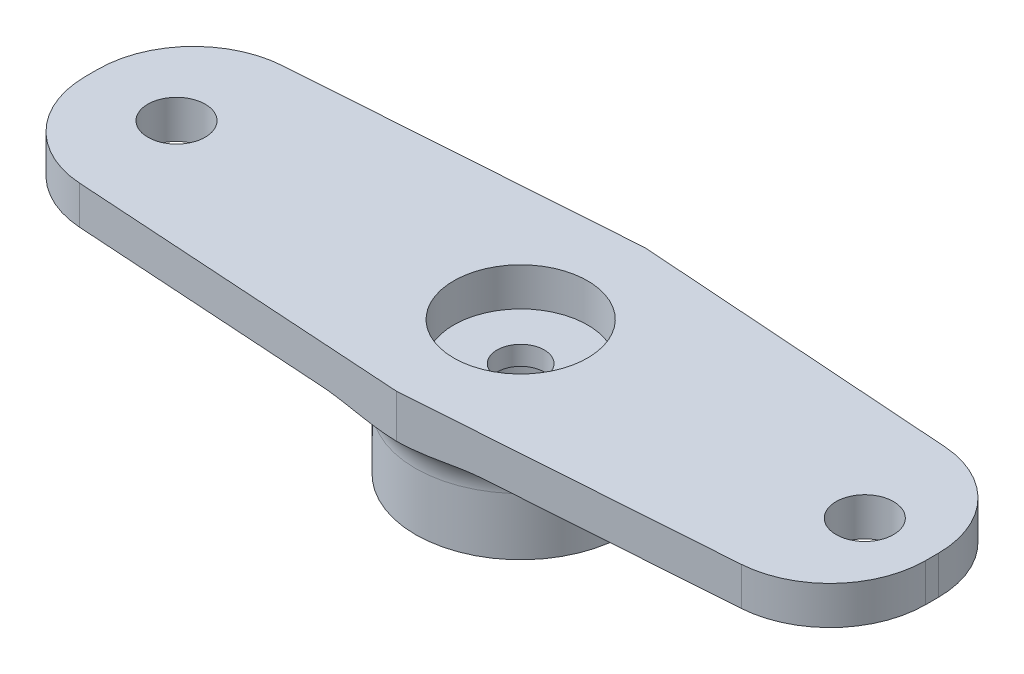
ISO-10303-21;
HEADER;
FILE_DESCRIPTION(('STEP AP214'),'2;1');
FILE_NAME('part.step','',(''),(''),'','','');
FILE_SCHEMA(('AUTOMOTIVE_DESIGN { 1 0 10303 214 1 1 1 1 }'));
ENDSEC;
DATA;
#1=APPLICATION_CONTEXT('core data for automotive mechanical design processes');
#2=APPLICATION_PROTOCOL_DEFINITION('international standard','automotive_design',2000,#1);
#3=PRODUCT_CONTEXT('',#1,'mechanical');
#4=PRODUCT('Part','Part','',(#3));
#5=PRODUCT_RELATED_PRODUCT_CATEGORY('part','',(#4));
#6=PRODUCT_DEFINITION_FORMATION('','',#4);
#7=PRODUCT_DEFINITION_CONTEXT('part definition',#1,'design');
#8=PRODUCT_DEFINITION('design','',#6,#7);
#9=PRODUCT_DEFINITION_SHAPE('','',#8);
#10=(LENGTH_UNIT() NAMED_UNIT(*) SI_UNIT(.MILLI.,.METRE.));
#11=(NAMED_UNIT(*) PLANE_ANGLE_UNIT() SI_UNIT($,.RADIAN.));
#12=(NAMED_UNIT(*) SI_UNIT($,.STERADIAN.) SOLID_ANGLE_UNIT());
#13=UNCERTAINTY_MEASURE_WITH_UNIT(LENGTH_MEASURE(1.E-05),#10,'distance_accuracy_value','');
#14=(GEOMETRIC_REPRESENTATION_CONTEXT(3) GLOBAL_UNCERTAINTY_ASSIGNED_CONTEXT((#13)) GLOBAL_UNIT_ASSIGNED_CONTEXT((#10,
#11,#12)) REPRESENTATION_CONTEXT('',''));
#15=CARTESIAN_POINT('',(0.,0.,0.));
#16=DIRECTION('',(0.,0.,1.));
#17=DIRECTION('',(1.,0.,0.));
#18=AXIS2_PLACEMENT_3D('',#15,#16,#17);
#19=CARTESIAN_POINT('',(0.,0.,0.));
#20=DIRECTION('',(0.,1.,0.));
#21=DIRECTION('',(0.,0.,1.));
#22=AXIS2_PLACEMENT_3D('',#19,#20,#21);
#23=PLANE('',#22);
#24=CARTESIAN_POINT('',(-18.,0.,0.));
#25=DIRECTION('',(0.,1.,0.));
#26=DIRECTION('',(0.,0.,1.));
#27=AXIS2_PLACEMENT_3D('',#24,#25,#26);
#28=CIRCLE('',#27,1.5);
#29=CARTESIAN_POINT('',(-18.,0.,1.5));
#30=VERTEX_POINT('',#29);
#31=EDGE_CURVE('E262',#30,#30,#28,.T.);
#32=ORIENTED_EDGE('',*,*,#31,.T.);
#33=EDGE_LOOP('',(#32));
#34=FACE_BOUND('',#33,.T.);
#35=DIRECTION('',(-0.997578251918466,0.,0.0695530826009639));
#36=VECTOR('',#35,1.);
#37=CARTESIAN_POINT('',(0.,0.,-6.5));
#38=LINE('',#37,#36);
#39=CARTESIAN_POINT('',(-4.21074409357818,0.,-6.20641878851214));
#40=VERTEX_POINT('',#39);
#41=CARTESIAN_POINT('',(-17.7327630498595,0.,-5.26363750835758));
#42=VERTEX_POINT('',#41);
#43=EDGE_CURVE('E295',#40,#42,#38,.T.);
#44=ORIENTED_EDGE('',*,*,#43,.F.);
#45=CARTESIAN_POINT('',(0.,0.,0.));
#46=DIRECTION('',(0.,1.,0.));
#47=DIRECTION('',(0.,0.,1.));
#48=AXIS2_PLACEMENT_3D('',#45,#46,#47);
#49=CIRCLE('',#48,7.5);
#50=CARTESIAN_POINT('',(-4.17327789108347,0.,6.23167326195733));
#51=VERTEX_POINT('',#50);
#52=EDGE_CURVE('E190',#40,#51,#49,.T.);
#53=ORIENTED_EDGE('',*,*,#52,.T.);
#54=DIRECTION('',(0.997939373392292,0.,0.0641639075602465));
#55=VECTOR('',#54,1.);
#56=CARTESIAN_POINT('',(0.,0.,6.5));
#57=LINE('',#56,#55);
#58=CARTESIAN_POINT('',(-17.7058171746559,0.,5.36157972441613));
#59=VERTEX_POINT('',#58);
#60=EDGE_CURVE('E276',#59,#51,#57,.T.);
#61=ORIENTED_EDGE('',*,*,#60,.F.);
#62=CARTESIAN_POINT('',(-17.3849976368547,0.,0.37188285745467));
#63=DIRECTION('',(0.,1.,0.));
#64=DIRECTION('',(0.,0.,1.));
#65=AXIS2_PLACEMENT_3D('',#62,#63,#64);
#66=CIRCLE('',#65,5.);
#67=CARTESIAN_POINT('',(-22.3849976368547,0.,0.371882857454668));
#68=VERTEX_POINT('',#67);
#69=EDGE_CURVE('E163',#59,#68,#66,.F.);
#70=ORIENTED_EDGE('',*,*,#69,.T.);
#71=DIRECTION('',(0.,0.,1.));
#72=VECTOR('',#71,1.);
#73=CARTESIAN_POINT('',(-22.3849976368547,0.,-4.93927472690555));
#74=LINE('',#73,#72);
#75=CARTESIAN_POINT('',(-22.3849976368547,0.,-0.275746248765253));
#76=VERTEX_POINT('',#75);
#77=EDGE_CURVE('E137',#76,#68,#74,.T.);
#78=ORIENTED_EDGE('',*,*,#77,.F.);
#79=CARTESIAN_POINT('',(-17.3849976368547,0.,-0.275746248765252));
#80=DIRECTION('',(0.,1.,0.));
#81=DIRECTION('',(0.,0.,1.));
#82=AXIS2_PLACEMENT_3D('',#79,#80,#81);
#83=CIRCLE('',#82,5.);
#84=EDGE_CURVE('E160',#76,#42,#83,.F.);
#85=ORIENTED_EDGE('',*,*,#84,.T.);
#86=EDGE_LOOP('',(#44,#53,#61,#70,#78,#85));
#87=FACE_BOUND('',#86,.T.);
#88=ADVANCED_FACE('F34',(#34,#87),#23,.F.);
#89=CARTESIAN_POINT('',(0.,2.,0.));
#90=DIRECTION('',(0.,1.,0.));
#91=DIRECTION('',(0.,0.,1.));
#92=AXIS2_PLACEMENT_3D('',#89,#90,#91);
#93=PLANE('',#92);
#94=CARTESIAN_POINT('',(-18.,2.,0.));
#95=DIRECTION('',(0.,1.,0.));
#96=DIRECTION('',(0.,0.,1.));
#97=AXIS2_PLACEMENT_3D('',#94,#95,#96);
#98=CIRCLE('',#97,1.5);
#99=CARTESIAN_POINT('',(-18.,2.,1.5));
#100=VERTEX_POINT('',#99);
#101=EDGE_CURVE('E268',#100,#100,#98,.T.);
#102=ORIENTED_EDGE('',*,*,#101,.F.);
#103=EDGE_LOOP('',(#102));
#104=FACE_BOUND('',#103,.T.);
#105=DIRECTION('',(0.,0.,1.));
#106=VECTOR('',#105,1.);
#107=CARTESIAN_POINT('',(-22.3849976368547,2.,-4.93927472690555));
#108=LINE('',#107,#106);
#109=CARTESIAN_POINT('',(-22.3849976368547,2.,-0.275746248765253));
#110=VERTEX_POINT('',#109);
#111=CARTESIAN_POINT('',(-22.3849976368547,2.,0.371882857454668));
#112=VERTEX_POINT('',#111);
#113=EDGE_CURVE('E152',#110,#112,#108,.T.);
#114=ORIENTED_EDGE('',*,*,#113,.T.);
#115=CARTESIAN_POINT('',(-17.3849976368547,2.,0.37188285745467));
#116=DIRECTION('',(0.,1.,0.));
#117=DIRECTION('',(0.,0.,1.));
#118=AXIS2_PLACEMENT_3D('',#115,#116,#117);
#119=CIRCLE('',#118,5.);
#120=CARTESIAN_POINT('',(-17.7058171746559,2.,5.36157972441613));
#121=VERTEX_POINT('',#120);
#122=EDGE_CURVE('E133',#112,#121,#119,.T.);
#123=ORIENTED_EDGE('',*,*,#122,.T.);
#124=DIRECTION('',(0.997939373392292,0.,0.0641639075602465));
#125=VECTOR('',#124,1.);
#126=CARTESIAN_POINT('',(0.,2.,6.5));
#127=LINE('',#126,#125);
#128=CARTESIAN_POINT('',(0.,2.,6.5));
#129=VERTEX_POINT('',#128);
#130=EDGE_CURVE('E126',#121,#129,#127,.T.);
#131=ORIENTED_EDGE('',*,*,#130,.T.);
#132=DIRECTION('',(0.997578251918466,0.,-0.0695530826009638));
#133=VECTOR('',#132,1.);
#134=CARTESIAN_POINT('',(0.,2.,6.5));
#135=LINE('',#134,#133);
#136=CARTESIAN_POINT('',(16.8617993266787,2.,5.32436278145204));
#137=VERTEX_POINT('',#136);
#138=EDGE_CURVE('E130',#129,#137,#135,.T.);
#139=ORIENTED_EDGE('',*,*,#138,.T.);
#140=CARTESIAN_POINT('',(16.5140339136739,2.,0.336471521859706));
#141=DIRECTION('',(0.,1.,0.));
#142=DIRECTION('',(0.,0.,1.));
#143=AXIS2_PLACEMENT_3D('',#140,#141,#142);
#144=CIRCLE('',#143,5.);
#145=CARTESIAN_POINT('',(21.5140339136739,2.,0.336471521859706));
#146=VERTEX_POINT('',#145);
#147=EDGE_CURVE('E170',#137,#146,#144,.T.);
#148=ORIENTED_EDGE('',*,*,#147,.T.);
#149=DIRECTION('',(0.,0.,-1.));
#150=VECTOR('',#149,1.);
#151=CARTESIAN_POINT('',(21.5140339136739,2.,-5.));
#152=LINE('',#151,#150);
#153=CARTESIAN_POINT('',(21.5140339136739,2.,-0.336471521859706));
#154=VERTEX_POINT('',#153);
#155=EDGE_CURVE('E142',#146,#154,#152,.T.);
#156=ORIENTED_EDGE('',*,*,#155,.T.);
#157=CARTESIAN_POINT('',(16.5140339136739,2.,-0.336471521859706));
#158=DIRECTION('',(0.,1.,0.));
#159=DIRECTION('',(0.,0.,1.));
#160=AXIS2_PLACEMENT_3D('',#157,#158,#159);
#161=CIRCLE('',#160,5.);
#162=CARTESIAN_POINT('',(16.8617993266787,2.,-5.32436278145204));
#163=VERTEX_POINT('',#162);
#164=EDGE_CURVE('E172',#154,#163,#161,.T.);
#165=ORIENTED_EDGE('',*,*,#164,.T.);
#166=DIRECTION('',(-0.997578251918466,0.,-0.0695530826009638));
#167=VECTOR('',#166,1.);
#168=CARTESIAN_POINT('',(0.,2.,-6.5));
#169=LINE('',#168,#167);
#170=CARTESIAN_POINT('',(0.,2.,-6.5));
#171=VERTEX_POINT('',#170);
#172=EDGE_CURVE('E281',#163,#171,#169,.T.);
#173=ORIENTED_EDGE('',*,*,#172,.T.);
#174=DIRECTION('',(-0.997578251918466,0.,0.0695530826009639));
#175=VECTOR('',#174,1.);
#176=CARTESIAN_POINT('',(0.,2.,-6.5));
#177=LINE('',#176,#175);
#178=CARTESIAN_POINT('',(-17.7327630498595,2.,-5.26363750835758));
#179=VERTEX_POINT('',#178);
#180=EDGE_CURVE('E283',#171,#179,#177,.T.);
#181=ORIENTED_EDGE('',*,*,#180,.T.);
#182=CARTESIAN_POINT('',(-17.3849976368547,2.,-0.275746248765252));
#183=DIRECTION('',(0.,1.,0.));
#184=DIRECTION('',(0.,0.,1.));
#185=AXIS2_PLACEMENT_3D('',#182,#183,#184);
#186=CIRCLE('',#185,5.);
#187=EDGE_CURVE('E174',#179,#110,#186,.T.);
#188=ORIENTED_EDGE('',*,*,#187,.T.);
#189=EDGE_LOOP('',(#114,#123,#131,#139,#148,#156,#165,#173,#181,#188));
#190=FACE_BOUND('',#189,.T.);
#191=CARTESIAN_POINT('',(0.,2.,0.));
#192=DIRECTION('',(0.,1.,0.));
#193=DIRECTION('',(0.,0.,1.));
#194=AXIS2_PLACEMENT_3D('',#191,#192,#193);
#195=CIRCLE('',#194,3.5);
#196=CARTESIAN_POINT('',(0.,2.,3.5));
#197=VERTEX_POINT('',#196);
#198=EDGE_CURVE('E273',#197,#197,#195,.T.);
#199=ORIENTED_EDGE('',*,*,#198,.F.);
#200=EDGE_LOOP('',(#199));
#201=FACE_BOUND('',#200,.T.);
#202=CARTESIAN_POINT('',(18.,2.,0.));
#203=DIRECTION('',(0.,1.,0.));
#204=DIRECTION('',(0.,0.,1.));
#205=AXIS2_PLACEMENT_3D('',#202,#203,#204);
#206=CIRCLE('',#205,1.5);
#207=CARTESIAN_POINT('',(18.,2.,1.5));
#208=VERTEX_POINT('',#207);
#209=EDGE_CURVE('E258',#208,#208,#206,.T.);
#210=ORIENTED_EDGE('',*,*,#209,.F.);
#211=EDGE_LOOP('',(#210));
#212=FACE_BOUND('',#211,.T.);
#213=ADVANCED_FACE('F128',(#104,#190,#201,#212),#93,.T.);
#214=DIRECTION('',(0.997578251918466,0.,-0.0695530826009638));
#215=VECTOR('',#214,1.);
#216=CARTESIAN_POINT('',(0.,0.,6.5));
#217=LINE('',#216,#215);
#218=CARTESIAN_POINT('',(4.21074409357817,0.,6.20641878851214));
#219=VERTEX_POINT('',#218);
#220=CARTESIAN_POINT('',(16.8617993266787,0.,5.32436278145204));
#221=VERTEX_POINT('',#220);
#222=EDGE_CURVE('E252',#219,#221,#217,.T.);
#223=ORIENTED_EDGE('',*,*,#222,.F.);
#224=CARTESIAN_POINT('',(0.,0.,0.));
#225=DIRECTION('',(0.,1.,0.));
#226=DIRECTION('',(0.,0.,1.));
#227=AXIS2_PLACEMENT_3D('',#224,#225,#226);
#228=CIRCLE('',#227,7.5);
#229=CARTESIAN_POINT('',(4.21074409357817,0.,-6.20641878851214));
#230=VERTEX_POINT('',#229);
#231=EDGE_CURVE('E188',#219,#230,#228,.T.);
#232=ORIENTED_EDGE('',*,*,#231,.T.);
#233=DIRECTION('',(-0.997578251918466,0.,-0.0695530826009638));
#234=VECTOR('',#233,1.);
#235=CARTESIAN_POINT('',(0.,0.,-6.5));
#236=LINE('',#235,#234);
#237=CARTESIAN_POINT('',(16.8617993266787,0.,-5.32436278145204));
#238=VERTEX_POINT('',#237);
#239=EDGE_CURVE('E292',#238,#230,#236,.T.);
#240=ORIENTED_EDGE('',*,*,#239,.F.);
#241=CARTESIAN_POINT('',(16.5140339136739,0.,-0.336471521859706));
#242=DIRECTION('',(0.,1.,0.));
#243=DIRECTION('',(0.,0.,1.));
#244=AXIS2_PLACEMENT_3D('',#241,#242,#243);
#245=CIRCLE('',#244,5.);
#246=CARTESIAN_POINT('',(21.5140339136739,0.,-0.336471521859706));
#247=VERTEX_POINT('',#246);
#248=EDGE_CURVE('E158',#238,#247,#245,.F.);
#249=ORIENTED_EDGE('',*,*,#248,.T.);
#250=DIRECTION('',(0.,0.,-1.));
#251=VECTOR('',#250,1.);
#252=CARTESIAN_POINT('',(21.5140339136739,0.,-5.));
#253=LINE('',#252,#251);
#254=CARTESIAN_POINT('',(21.5140339136739,0.,0.336471521859706));
#255=VERTEX_POINT('',#254);
#256=EDGE_CURVE('E289',#255,#247,#253,.T.);
#257=ORIENTED_EDGE('',*,*,#256,.F.);
#258=CARTESIAN_POINT('',(16.5140339136739,0.,0.336471521859706));
#259=DIRECTION('',(0.,1.,0.));
#260=DIRECTION('',(0.,0.,1.));
#261=AXIS2_PLACEMENT_3D('',#258,#259,#260);
#262=CIRCLE('',#261,5.);
#263=EDGE_CURVE('E150',#255,#221,#262,.F.);
#264=ORIENTED_EDGE('',*,*,#263,.T.);
#265=EDGE_LOOP('',(#223,#232,#240,#249,#257,#264));
#266=FACE_BOUND('',#265,.T.);
#267=CARTESIAN_POINT('',(18.,0.,0.));
#268=DIRECTION('',(0.,1.,0.));
#269=DIRECTION('',(0.,0.,1.));
#270=AXIS2_PLACEMENT_3D('',#267,#268,#269);
#271=CIRCLE('',#270,1.5);
#272=CARTESIAN_POINT('',(18.,0.,1.5));
#273=VERTEX_POINT('',#272);
#274=EDGE_CURVE('E256',#273,#273,#271,.T.);
#275=ORIENTED_EDGE('',*,*,#274,.T.);
#276=EDGE_LOOP('',(#275));
#277=FACE_BOUND('',#276,.T.);
#278=ADVANCED_FACE('F210',(#266,#277),#23,.F.);
#279=CARTESIAN_POINT('',(0.,2.,6.5));
#280=DIRECTION('',(0.0641639075602465,0.,-0.997939373392292));
#281=DIRECTION('',(-0.997939373392292,0.,-0.0641639075602465));
#282=AXIS2_PLACEMENT_3D('',#279,#280,#281);
#283=PLANE('',#282);
#284=ORIENTED_EDGE('',*,*,#130,.F.);
#285=DIRECTION('',(0.,-1.,0.));
#286=VECTOR('',#285,1.);
#287=CARTESIAN_POINT('',(-17.7058171746559,2.,5.36157972441613));
#288=LINE('',#287,#286);
#289=EDGE_CURVE('E148',#121,#59,#288,.T.);
#290=ORIENTED_EDGE('',*,*,#289,.T.);
#291=ORIENTED_EDGE('',*,*,#60,.T.);
#292=CARTESIAN_POINT('',(-4.17327789108347,0.,6.23167326195733));
#293=CARTESIAN_POINT('',(-3.99866153561937,-2.70327072855821E-05,6.24290046472058));
#294=CARTESIAN_POINT('',(-3.82422759759474,-0.00577769852826314,6.25411593869946));
#295=CARTESIAN_POINT('',(-3.47605392262897,-0.02533306875963,6.27650225202777));
#296=CARTESIAN_POINT('',(-3.3023135298705,-0.0391253338612562,6.28767313354389));
#297=CARTESIAN_POINT('',(-2.95548656792677,-0.0713758466282562,6.30997285807516));
#298=CARTESIAN_POINT('',(-2.78239952595794,-0.0898295248789498,6.32110173148859));
#299=CARTESIAN_POINT('',(-2.43629988825527,-0.128152173713977,6.34335469169068));
#300=CARTESIAN_POINT('',(-2.26328736858739,-0.148021822011773,6.35447877358856));
#301=CARTESIAN_POINT('',(-1.91667805788343,-0.185971911423211,6.376764503929));
#302=CARTESIAN_POINT('',(-1.7430808144278,-0.204048367981637,6.3879261814605));
#303=CARTESIAN_POINT('',(-1.39550232259994,-0.235300665252358,6.41027422665664));
#304=CARTESIAN_POINT('',(-1.22152131272378,-0.248478978800876,6.42146057898683));
#305=CARTESIAN_POINT('',(-0.960226821022833,-0.262820963064437,6.4382608737327));
#306=CARTESIAN_POINT('',(-0.873061389403507,-0.266697555649852,6.44386529705338));
#307=CARTESIAN_POINT('',(-0.698664154940713,-0.272470388575559,6.45507841112543));
#308=CARTESIAN_POINT('',(-0.611432352448419,-0.274366639322139,6.46068710185421));
#309=CARTESIAN_POINT('',(-0.436815730258655,-0.276077722613637,6.47191432176696));
#310=CARTESIAN_POINT('',(-0.349430879626261,-0.275889384960291,6.47753285293993));
#311=CARTESIAN_POINT('',(-0.174684475965654,-0.273454938882778,6.48876841733384));
#312=CARTESIAN_POINT('',(-0.0873229246068644,-0.271208709621921,6.49438545044744));
#313=CARTESIAN_POINT('',(0.,-0.267949192431025,6.5));
#314=B_SPLINE_CURVE_WITH_KNOTS('',3,(#292,#293,#294,#295,#296,#297,#298,#299,#300,#301,#302,
#303,#304,#305,#306,#307,#308,#309,#310,#311,#312,#313),.UNSPECIFIED.,.F.,.F.,(4,2,2,2,2,2,2,2,
2,2,4),(0.,0.524582922831481,1.04835652887097,1.57161867767837,2.09513297511022,
2.61978564644113,3.14417308500021,3.40644753643513,3.66872060966492,3.9313925970115,
4.1940800091006),.UNSPECIFIED.);
#315=CARTESIAN_POINT('',(0.,-0.267949192431123,6.5));
#316=VERTEX_POINT('',#315);
#317=EDGE_CURVE('E146',#51,#316,#314,.T.);
#318=ORIENTED_EDGE('',*,*,#317,.T.);
#319=DIRECTION('',(0.,-1.,0.));
#320=VECTOR('',#319,1.);
#321=CARTESIAN_POINT('',(0.,2.,6.5));
#322=LINE('',#321,#320);
#323=EDGE_CURVE('E58',#129,#316,#322,.T.);
#324=ORIENTED_EDGE('',*,*,#323,.F.);
#325=EDGE_LOOP('',(#284,#290,#291,#318,#324));
#326=FACE_BOUND('',#325,.T.);
#327=ADVANCED_FACE('F144',(#326),#283,.F.);
#328=CARTESIAN_POINT('',(0.,2.,6.5));
#329=DIRECTION('',(-0.0695530826009638,0.,-0.997578251918467));
#330=DIRECTION('',(-0.997578251918467,0.,0.0695530826009638));
#331=AXIS2_PLACEMENT_3D('',#328,#329,#330);
#332=PLANE('',#331);
#333=ORIENTED_EDGE('',*,*,#323,.T.);
#334=CARTESIAN_POINT('',(0.,-0.267949192431123,6.5));
#335=CARTESIAN_POINT('',(0.0881063764120673,-0.271514389429681,6.49385705325424));
#336=CARTESIAN_POINT('',(0.176255368463644,-0.274054279043273,6.48771113526379));
#337=CARTESIAN_POINT('',(0.352583844489764,-0.277038164278074,6.4754171733271));
#338=CARTESIAN_POINT('',(0.440763326621111,-0.277482269895564,6.46926912950939));
#339=CARTESIAN_POINT('',(0.616969750006151,-0.276230668679722,6.4569836773186));
#340=CARTESIAN_POINT('',(0.704996714624166,-0.274538298975229,6.45084626731651));
#341=CARTESIAN_POINT('',(0.880986747288274,-0.269113991892278,6.43857590230475));
#342=CARTESIAN_POINT('',(0.968949815155507,-0.265382048826527,6.43244294730755));
#343=CARTESIAN_POINT('',(1.23263277360856,-0.251379110472312,6.41405846212608));
#344=CARTESIAN_POINT('',(1.40820476187212,-0.238300395283495,6.4018172439774));
#345=CARTESIAN_POINT('',(1.75895034561754,-0.207024799390156,6.3773625843943));
#346=CARTESIAN_POINT('',(1.9341236881519,-0.188825275650009,6.36514916059587));
#347=CARTESIAN_POINT('',(2.28383436851782,-0.15049120774808,6.34076665647536));
#348=CARTESIAN_POINT('',(2.45837223426697,-0.130361303799394,6.32859753934585));
#349=CARTESIAN_POINT('',(2.80751573275345,-0.0914712201037337,6.30425458024152));
#350=CARTESIAN_POINT('',(2.9821212905677,-0.0727103750957372,6.29208074349049));
#351=CARTESIAN_POINT('',(3.33200813761278,-0.0398904491202879,6.26768595668883));
#352=CARTESIAN_POINT('',(3.50728994253932,-0.0258363054934833,6.25546497068292));
#353=CARTESIAN_POINT('',(3.85856567509061,-0.00589853285241581,6.23097334810106));
#354=CARTESIAN_POINT('',(4.03456028960376,-2.78125835379991E-05,6.21870266363394));
#355=CARTESIAN_POINT('',(4.21074409357817,0.,6.20641878851214));
#356=B_SPLINE_CURVE_WITH_KNOTS('',3,(#334,#335,#336,#337,#338,#339,#340,#341,#342,#343,#344,
#345,#346,#347,#348,#349,#350,#351,#352,#353,#354,#355),.UNSPECIFIED.,.F.,.F.,(4,2,2,2,2,2,2,2,
2,2,4),(0.,0.265172686530202,0.530331455436394,0.795076563991771,1.05982241078514,
1.58913880266127,2.11872889672141,2.64707644393611,3.17516551986589,3.70380683984224,
4.23328111236857),.UNSPECIFIED.);
#357=EDGE_CURVE('E201',#316,#219,#356,.T.);
#358=ORIENTED_EDGE('',*,*,#357,.T.);
#359=ORIENTED_EDGE('',*,*,#222,.T.);
#360=DIRECTION('',(0.,-1.,0.));
#361=VECTOR('',#360,1.);
#362=CARTESIAN_POINT('',(16.8617993266787,2.,5.32436278145204));
#363=LINE('',#362,#361);
#364=EDGE_CURVE('E141',#221,#137,#363,.F.);
#365=ORIENTED_EDGE('',*,*,#364,.T.);
#366=ORIENTED_EDGE('',*,*,#138,.F.);
#367=EDGE_LOOP('',(#333,#358,#359,#365,#366));
#368=FACE_BOUND('',#367,.T.);
#369=ADVANCED_FACE('F139',(#368),#332,.F.);
#370=CARTESIAN_POINT('',(21.5140339136739,2.,-5.));
#371=DIRECTION('',(-1.,0.,0.));
#372=DIRECTION('',(0.,0.,1.));
#373=AXIS2_PLACEMENT_3D('',#370,#371,#372);
#374=PLANE('',#373);
#375=ORIENTED_EDGE('',*,*,#256,.T.);
#376=DIRECTION('',(0.,-1.,0.));
#377=VECTOR('',#376,1.);
#378=CARTESIAN_POINT('',(21.5140339136739,2.,-0.336471521859706));
#379=LINE('',#378,#377);
#380=EDGE_CURVE('E185',#247,#154,#379,.F.);
#381=ORIENTED_EDGE('',*,*,#380,.T.);
#382=ORIENTED_EDGE('',*,*,#155,.F.);
#383=DIRECTION('',(0.,-1.,0.));
#384=VECTOR('',#383,1.);
#385=CARTESIAN_POINT('',(21.5140339136739,2.,0.336471521859706));
#386=LINE('',#385,#384);
#387=EDGE_CURVE('E182',#146,#255,#386,.T.);
#388=ORIENTED_EDGE('',*,*,#387,.T.);
#389=EDGE_LOOP('',(#375,#381,#382,#388));
#390=FACE_BOUND('',#389,.T.);
#391=ADVANCED_FACE('F322',(#390),#374,.F.);
#392=CARTESIAN_POINT('',(0.,2.,-6.5));
#393=DIRECTION('',(-0.0695530826009638,0.,0.997578251918467));
#394=DIRECTION('',(0.997578251918467,0.,0.0695530826009638));
#395=AXIS2_PLACEMENT_3D('',#392,#393,#394);
#396=PLANE('',#395);
#397=ORIENTED_EDGE('',*,*,#172,.F.);
#398=DIRECTION('',(0.,-1.,0.));
#399=VECTOR('',#398,1.);
#400=CARTESIAN_POINT('',(16.8617993266787,2.,-5.32436278145204));
#401=LINE('',#400,#399);
#402=EDGE_CURVE('E179',#163,#238,#401,.T.);
#403=ORIENTED_EDGE('',*,*,#402,.T.);
#404=ORIENTED_EDGE('',*,*,#239,.T.);
#405=CARTESIAN_POINT('',(4.21074409357817,0.,-6.20641878851214));
#406=CARTESIAN_POINT('',(4.03456028960376,-2.78125835387186E-05,-6.21870266363394));
#407=CARTESIAN_POINT('',(3.85856567509061,-0.00589853285241654,-6.23097334810106));
#408=CARTESIAN_POINT('',(3.50728994253932,-0.0258363054934837,-6.25546497068292));
#409=CARTESIAN_POINT('',(3.33200813761278,-0.039890449120288,-6.26768595668883));
#410=CARTESIAN_POINT('',(2.9821212905677,-0.0727103750957368,-6.29208074349049));
#411=CARTESIAN_POINT('',(2.80751573275346,-0.0914712201037332,-6.30425458024152));
#412=CARTESIAN_POINT('',(2.45837223426698,-0.130361303799393,-6.32859753934585));
#413=CARTESIAN_POINT('',(2.28383436851783,-0.150491207748079,-6.34076665647536));
#414=CARTESIAN_POINT('',(1.93412368815191,-0.188825275650009,-6.36514916059587));
#415=CARTESIAN_POINT('',(1.75895034561755,-0.207024799390156,-6.3773625843943));
#416=CARTESIAN_POINT('',(1.40820476187212,-0.238300395283495,-6.4018172439774));
#417=CARTESIAN_POINT('',(1.23263277360856,-0.251379110472311,-6.41405846212608));
#418=CARTESIAN_POINT('',(0.968949815155511,-0.265382048826526,-6.43244294730755));
#419=CARTESIAN_POINT('',(0.880986747288276,-0.269113991892278,-6.43857590230475));
#420=CARTESIAN_POINT('',(0.704996714624167,-0.274538298975229,-6.45084626731651));
#421=CARTESIAN_POINT('',(0.616969750006152,-0.276230668679719,-6.4569836773186));
#422=CARTESIAN_POINT('',(0.440763326621111,-0.277482269895566,-6.46926912950939));
#423=CARTESIAN_POINT('',(0.352583844489763,-0.277038164278083,-6.4754171733271));
#424=CARTESIAN_POINT('',(0.176255368463642,-0.274054279043264,-6.48771113526379));
#425=CARTESIAN_POINT('',(0.0881063764120657,-0.271514389429647,-6.49385705325424));
#426=CARTESIAN_POINT('',(0.,-0.267949192431026,-6.5));
#427=B_SPLINE_CURVE_WITH_KNOTS('',3,(#405,#406,#407,#408,#409,#410,#411,#412,#413,#414,#415,
#416,#417,#418,#419,#420,#421,#422,#423,#424,#425,#426),.UNSPECIFIED.,.F.,.F.,(4,2,2,2,2,2,2,2,
2,2,4),(0.,0.529474272526324,1.05811559250268,1.58620466843246,2.11455221564716,
2.64414230970729,3.17345870158343,3.4382045483768,3.70294965693217,3.96810842583837,
4.23328111236857),.UNSPECIFIED.);
#428=CARTESIAN_POINT('',(0.,-0.267949192431123,-6.5));
#429=VERTEX_POINT('',#428);
#430=EDGE_CURVE('E44',#230,#429,#427,.T.);
#431=ORIENTED_EDGE('',*,*,#430,.T.);
#432=DIRECTION('',(0.,-1.,0.));
#433=VECTOR('',#432,1.);
#434=CARTESIAN_POINT('',(0.,2.,-6.5));
#435=LINE('',#434,#433);
#436=EDGE_CURVE('E50',#171,#429,#435,.T.);
#437=ORIENTED_EDGE('',*,*,#436,.F.);
#438=EDGE_LOOP('',(#397,#403,#404,#431,#437));
#439=FACE_BOUND('',#438,.T.);
#440=ADVANCED_FACE('F318',(#439),#396,.F.);
#441=CARTESIAN_POINT('',(0.,2.,-6.5));
#442=DIRECTION('',(0.0695530826009639,0.,0.997578251918467));
#443=DIRECTION('',(0.997578251918467,0.,-0.0695530826009639));
#444=AXIS2_PLACEMENT_3D('',#441,#442,#443);
#445=PLANE('',#444);
#446=ORIENTED_EDGE('',*,*,#436,.T.);
#447=CARTESIAN_POINT('',(0.,-0.267949192431123,-6.5));
#448=CARTESIAN_POINT('',(-0.0881063764120675,-0.271514389429681,-6.49385705325424));
#449=CARTESIAN_POINT('',(-0.176255368463644,-0.274054279043273,-6.48771113526379));
#450=CARTESIAN_POINT('',(-0.352583844489764,-0.277038164278074,-6.4754171733271));
#451=CARTESIAN_POINT('',(-0.440763326621111,-0.277482269895563,-6.46926912950939));
#452=CARTESIAN_POINT('',(-0.616969750006151,-0.276230668679722,-6.4569836773186));
#453=CARTESIAN_POINT('',(-0.704996714624166,-0.27453829897523,-6.45084626731651));
#454=CARTESIAN_POINT('',(-0.880986747288274,-0.269113991892278,-6.43857590230475));
#455=CARTESIAN_POINT('',(-0.968949815155507,-0.265382048826527,-6.43244294730755));
#456=CARTESIAN_POINT('',(-1.23263277360856,-0.251379110472312,-6.41405846212608));
#457=CARTESIAN_POINT('',(-1.40820476187212,-0.238300395283495,-6.4018172439774));
#458=CARTESIAN_POINT('',(-1.75895034561754,-0.207024799390156,-6.3773625843943));
#459=CARTESIAN_POINT('',(-1.9341236881519,-0.18882527565001,-6.36514916059587));
#460=CARTESIAN_POINT('',(-2.28383436851782,-0.15049120774808,-6.34076665647536));
#461=CARTESIAN_POINT('',(-2.45837223426697,-0.130361303799394,-6.32859753934585));
#462=CARTESIAN_POINT('',(-2.80751573275345,-0.0914712201037332,-6.30425458024152));
#463=CARTESIAN_POINT('',(-2.9821212905677,-0.0727103750957368,-6.29208074349049));
#464=CARTESIAN_POINT('',(-3.33200813761278,-0.0398904491202878,-6.26768595668883));
#465=CARTESIAN_POINT('',(-3.50728994253932,-0.0258363054934836,-6.25546497068292));
#466=CARTESIAN_POINT('',(-3.85856567509061,-0.00589853285241645,-6.23097334810106));
#467=CARTESIAN_POINT('',(-4.03456028960376,-2.78125835387198E-05,-6.21870266363393));
#468=CARTESIAN_POINT('',(-4.21074409357818,0.,-6.20641878851214));
#469=B_SPLINE_CURVE_WITH_KNOTS('',3,(#447,#448,#449,#450,#451,#452,#453,#454,#455,#456,#457,
#458,#459,#460,#461,#462,#463,#464,#465,#466,#467,#468),.UNSPECIFIED.,.F.,.F.,(4,2,2,2,2,2,2,2,
2,2,4),(0.,0.265172686530202,0.530331455436394,0.795076563991772,1.05982241078514,
1.58913880266127,2.11872889672141,2.64707644393611,3.17516551986589,3.70380683984224,
4.23328111236857),.UNSPECIFIED.);
#470=EDGE_CURVE('E11',#429,#40,#469,.T.);
#471=ORIENTED_EDGE('',*,*,#470,.T.);
#472=ORIENTED_EDGE('',*,*,#43,.T.);
#473=DIRECTION('',(0.,-1.,0.));
#474=VECTOR('',#473,1.);
#475=CARTESIAN_POINT('',(-17.7327630498595,2.,-5.26363750835758));
#476=LINE('',#475,#474);
#477=EDGE_CURVE('E177',#42,#179,#476,.F.);
#478=ORIENTED_EDGE('',*,*,#477,.T.);
#479=ORIENTED_EDGE('',*,*,#180,.F.);
#480=EDGE_LOOP('',(#446,#471,#472,#478,#479));
#481=FACE_BOUND('',#480,.T.);
#482=ADVANCED_FACE('F321',(#481),#445,.F.);
#483=CARTESIAN_POINT('',(-22.3849976368547,2.,-4.93927472690555));
#484=DIRECTION('',(1.,0.,0.));
#485=DIRECTION('',(0.,0.,-1.));
#486=AXIS2_PLACEMENT_3D('',#483,#484,#485);
#487=PLANE('',#486);
#488=ORIENTED_EDGE('',*,*,#77,.T.);
#489=DIRECTION('',(0.,-1.,0.));
#490=VECTOR('',#489,1.);
#491=CARTESIAN_POINT('',(-22.3849976368547,2.,0.371882857454668));
#492=LINE('',#491,#490);
#493=EDGE_CURVE('E168',#68,#112,#492,.F.);
#494=ORIENTED_EDGE('',*,*,#493,.T.);
#495=ORIENTED_EDGE('',*,*,#113,.F.);
#496=DIRECTION('',(0.,-1.,0.));
#497=VECTOR('',#496,1.);
#498=CARTESIAN_POINT('',(-22.3849976368547,2.,-0.275746248765253));
#499=LINE('',#498,#497);
#500=EDGE_CURVE('E165',#110,#76,#499,.T.);
#501=ORIENTED_EDGE('',*,*,#500,.T.);
#502=EDGE_LOOP('',(#488,#494,#495,#501));
#503=FACE_BOUND('',#502,.T.);
#504=ADVANCED_FACE('F300',(#503),#487,.F.);
#505=CARTESIAN_POINT('',(0.,2.,0.));
#506=DIRECTION('',(0.,-1.,0.));
#507=DIRECTION('',(0.,0.,-1.));
#508=AXIS2_PLACEMENT_3D('',#505,#506,#507);
#509=CYLINDRICAL_SURFACE('',#508,3.5);
#510=ORIENTED_EDGE('',*,*,#198,.T.);
#511=EDGE_LOOP('',(#510));
#512=FACE_BOUND('',#511,.T.);
#513=CARTESIAN_POINT('',(0.,0.,0.));
#514=DIRECTION('',(0.,1.,0.));
#515=DIRECTION('',(0.,0.,1.));
#516=AXIS2_PLACEMENT_3D('',#513,#514,#515);
#517=CIRCLE('',#516,3.5);
#518=CARTESIAN_POINT('',(0.,0.,3.5));
#519=VERTEX_POINT('',#518);
#520=EDGE_CURVE('E271',#519,#519,#517,.T.);
#521=ORIENTED_EDGE('',*,*,#520,.F.);
#522=EDGE_LOOP('',(#521));
#523=FACE_BOUND('',#522,.T.);
#524=ADVANCED_FACE('F343',(#512,#523),#509,.F.);
#525=CARTESIAN_POINT('',(-18.,2.,0.));
#526=DIRECTION('',(0.,-1.,0.));
#527=DIRECTION('',(0.,0.,-1.));
#528=AXIS2_PLACEMENT_3D('',#525,#526,#527);
#529=CYLINDRICAL_SURFACE('',#528,1.5);
#530=ORIENTED_EDGE('',*,*,#101,.T.);
#531=EDGE_LOOP('',(#530));
#532=FACE_BOUND('',#531,.T.);
#533=ORIENTED_EDGE('',*,*,#31,.F.);
#534=EDGE_LOOP('',(#533));
#535=FACE_BOUND('',#534,.T.);
#536=ADVANCED_FACE('F347',(#532,#535),#529,.F.);
#537=CARTESIAN_POINT('',(18.,2.,0.));
#538=DIRECTION('',(0.,-1.,0.));
#539=DIRECTION('',(0.,0.,-1.));
#540=AXIS2_PLACEMENT_3D('',#537,#538,#539);
#541=CYLINDRICAL_SURFACE('',#540,1.5);
#542=ORIENTED_EDGE('',*,*,#209,.T.);
#543=EDGE_LOOP('',(#542));
#544=FACE_BOUND('',#543,.T.);
#545=ORIENTED_EDGE('',*,*,#274,.F.);
#546=EDGE_LOOP('',(#545));
#547=FACE_BOUND('',#546,.T.);
#548=ADVANCED_FACE('F217',(#544,#547),#541,.F.);
#549=CARTESIAN_POINT('',(-17.3849976368547,2.,0.37188285745467));
#550=DIRECTION('',(0.,-1.,0.));
#551=DIRECTION('',(0.,0.,-1.));
#552=AXIS2_PLACEMENT_3D('',#549,#550,#551);
#553=CYLINDRICAL_SURFACE('',#552,5.);
#554=ORIENTED_EDGE('',*,*,#122,.F.);
#555=ORIENTED_EDGE('',*,*,#493,.F.);
#556=ORIENTED_EDGE('',*,*,#69,.F.);
#557=ORIENTED_EDGE('',*,*,#289,.F.);
#558=EDGE_LOOP('',(#554,#555,#556,#557));
#559=FACE_BOUND('',#558,.T.);
#560=ADVANCED_FACE('F213',(#559),#553,.T.);
#561=CARTESIAN_POINT('',(-17.3849976368547,2.,-0.275746248765252));
#562=DIRECTION('',(0.,-1.,0.));
#563=DIRECTION('',(0.,0.,-1.));
#564=AXIS2_PLACEMENT_3D('',#561,#562,#563);
#565=CYLINDRICAL_SURFACE('',#564,5.);
#566=ORIENTED_EDGE('',*,*,#187,.F.);
#567=ORIENTED_EDGE('',*,*,#477,.F.);
#568=ORIENTED_EDGE('',*,*,#84,.F.);
#569=ORIENTED_EDGE('',*,*,#500,.F.);
#570=EDGE_LOOP('',(#566,#567,#568,#569));
#571=FACE_BOUND('',#570,.T.);
#572=ADVANCED_FACE('F216',(#571),#565,.T.);
#573=CARTESIAN_POINT('',(16.5140339136739,2.,-0.336471521859706));
#574=DIRECTION('',(0.,-1.,0.));
#575=DIRECTION('',(0.,0.,-1.));
#576=AXIS2_PLACEMENT_3D('',#573,#574,#575);
#577=CYLINDRICAL_SURFACE('',#576,5.);
#578=ORIENTED_EDGE('',*,*,#164,.F.);
#579=ORIENTED_EDGE('',*,*,#380,.F.);
#580=ORIENTED_EDGE('',*,*,#248,.F.);
#581=ORIENTED_EDGE('',*,*,#402,.F.);
#582=EDGE_LOOP('',(#578,#579,#580,#581));
#583=FACE_BOUND('',#582,.T.);
#584=ADVANCED_FACE('F221',(#583),#577,.T.);
#585=CARTESIAN_POINT('',(16.5140339136739,2.,0.336471521859706));
#586=DIRECTION('',(0.,-1.,0.));
#587=DIRECTION('',(0.,0.,-1.));
#588=AXIS2_PLACEMENT_3D('',#585,#586,#587);
#589=CYLINDRICAL_SURFACE('',#588,5.);
#590=ORIENTED_EDGE('',*,*,#147,.F.);
#591=ORIENTED_EDGE('',*,*,#364,.F.);
#592=ORIENTED_EDGE('',*,*,#263,.F.);
#593=ORIENTED_EDGE('',*,*,#387,.F.);
#594=EDGE_LOOP('',(#590,#591,#592,#593));
#595=FACE_BOUND('',#594,.T.);
#596=ADVANCED_FACE('F224',(#595),#589,.T.);
#597=CARTESIAN_POINT('',(0.,0.,0.));
#598=DIRECTION('',(0.,1.,0.));
#599=DIRECTION('',(0.,0.,1.));
#600=AXIS2_PLACEMENT_3D('',#597,#598,#599);
#601=PLANE('',#600);
#602=CARTESIAN_POINT('',(0.,0.,0.));
#603=DIRECTION('',(0.,1.,0.));
#604=DIRECTION('',(0.,0.,1.));
#605=AXIS2_PLACEMENT_3D('',#602,#603,#604);
#606=CIRCLE('',#605,1.23550032933867);
#607=CARTESIAN_POINT('',(0.,0.,1.23550032933867));
#608=VERTEX_POINT('',#607);
#609=EDGE_CURVE('E265',#608,#608,#606,.T.);
#610=ORIENTED_EDGE('',*,*,#609,.F.);
#611=EDGE_LOOP('',(#610));
#612=FACE_BOUND('',#611,.T.);
#613=ORIENTED_EDGE('',*,*,#520,.T.);
#614=EDGE_LOOP('',(#613));
#615=FACE_BOUND('',#614,.T.);
#616=ADVANCED_FACE('F227',(#612,#615),#601,.T.);
#617=CARTESIAN_POINT('',(0.,-5.,0.));
#618=DIRECTION('',(0.,1.,0.));
#619=DIRECTION('',(0.,0.,1.));
#620=AXIS2_PLACEMENT_3D('',#617,#618,#619);
#621=CYLINDRICAL_SURFACE('',#620,5.5);
#622=CARTESIAN_POINT('',(0.,-2.,0.));
#623=DIRECTION('',(0.,1.,0.));
#624=DIRECTION('',(0.,0.,1.));
#625=AXIS2_PLACEMENT_3D('',#622,#623,#624);
#626=CIRCLE('',#625,5.5);
#627=CARTESIAN_POINT('',(0.,-2.,5.5));
#628=VERTEX_POINT('',#627);
#629=EDGE_CURVE('E193',#628,#628,#626,.F.);
#630=ORIENTED_EDGE('',*,*,#629,.T.);
#631=EDGE_LOOP('',(#630));
#632=FACE_BOUND('',#631,.T.);
#633=CARTESIAN_POINT('',(0.,-5.,0.));
#634=DIRECTION('',(0.,1.,0.));
#635=DIRECTION('',(0.,0.,1.));
#636=AXIS2_PLACEMENT_3D('',#633,#634,#635);
#637=CIRCLE('',#636,5.5);
#638=CARTESIAN_POINT('',(0.,-5.,5.5));
#639=VERTEX_POINT('',#638);
#640=EDGE_CURVE('E259',#639,#639,#637,.T.);
#641=ORIENTED_EDGE('',*,*,#640,.T.);
#642=EDGE_LOOP('',(#641));
#643=FACE_BOUND('',#642,.T.);
#644=ADVANCED_FACE('F232',(#632,#643),#621,.T.);
#645=CARTESIAN_POINT('',(0.,-5.,0.));
#646=DIRECTION('',(0.,1.,0.));
#647=DIRECTION('',(0.,0.,1.));
#648=AXIS2_PLACEMENT_3D('',#645,#646,#647);
#649=PLANE('',#648);
#650=CARTESIAN_POINT('',(0.,-5.,0.));
#651=DIRECTION('',(0.,1.,0.));
#652=DIRECTION('',(0.,0.,1.));
#653=AXIS2_PLACEMENT_3D('',#650,#651,#652);
#654=CIRCLE('',#653,3.);
#655=CARTESIAN_POINT('',(0.,-5.,3.));
#656=VERTEX_POINT('',#655);
#657=EDGE_CURVE('E390',#656,#656,#654,.T.);
#658=ORIENTED_EDGE('',*,*,#657,.T.);
#659=EDGE_LOOP('',(#658));
#660=FACE_BOUND('',#659,.T.);
#661=ORIENTED_EDGE('',*,*,#640,.F.);
#662=EDGE_LOOP('',(#661));
#663=FACE_BOUND('',#662,.T.);
#664=ADVANCED_FACE('F361',(#660,#663),#649,.F.);
#665=CARTESIAN_POINT('',(0.,-5.,0.));
#666=DIRECTION('',(0.,1.,0.));
#667=DIRECTION('',(0.,0.,1.));
#668=AXIS2_PLACEMENT_3D('',#665,#666,#667);
#669=CYLINDRICAL_SURFACE('',#668,1.23550032933867);
#670=CARTESIAN_POINT('',(0.,-1.,0.));
#671=DIRECTION('',(0.,1.,0.));
#672=DIRECTION('',(0.,0.,1.));
#673=AXIS2_PLACEMENT_3D('',#670,#671,#672);
#674=CIRCLE('',#673,1.23550032933867);
#675=CARTESIAN_POINT('',(0.,-1.,1.23550032933867));
#676=VERTEX_POINT('',#675);
#677=EDGE_CURVE('E39',#676,#676,#674,.F.);
#678=ORIENTED_EDGE('',*,*,#677,.T.);
#679=EDGE_LOOP('',(#678));
#680=FACE_BOUND('',#679,.T.);
#681=ORIENTED_EDGE('',*,*,#609,.T.);
#682=EDGE_LOOP('',(#681));
#683=FACE_BOUND('',#682,.T.);
#684=ADVANCED_FACE('F366',(#680,#683),#669,.F.);
#685=CARTESIAN_POINT('',(0.,-2.,0.));
#686=DIRECTION('',(0.,1.,0.));
#687=DIRECTION('',(0.,0.,1.));
#688=AXIS2_PLACEMENT_3D('',#685,#686,#687);
#689=TOROIDAL_SURFACE('',#688,7.5,2.);
#690=ORIENTED_EDGE('',*,*,#629,.F.);
#691=EDGE_LOOP('',(#690));
#692=FACE_BOUND('',#691,.T.);
#693=ORIENTED_EDGE('',*,*,#317,.F.);
#694=ORIENTED_EDGE('',*,*,#52,.F.);
#695=ORIENTED_EDGE('',*,*,#470,.F.);
#696=ORIENTED_EDGE('',*,*,#430,.F.);
#697=ORIENTED_EDGE('',*,*,#231,.F.);
#698=ORIENTED_EDGE('',*,*,#357,.F.);
#699=EDGE_LOOP('',(#693,#694,#695,#696,#697,#698));
#700=FACE_BOUND('',#699,.T.);
#701=ADVANCED_FACE('F36',(#692,#700),#689,.F.);
#702=CARTESIAN_POINT('',(0.,-1.,0.));
#703=DIRECTION('',(0.,1.,0.));
#704=DIRECTION('',(0.,0.,1.));
#705=AXIS2_PLACEMENT_3D('',#702,#703,#704);
#706=PLANE('',#705);
#707=CARTESIAN_POINT('',(0.,-1.,0.));
#708=DIRECTION('',(0.,1.,0.));
#709=DIRECTION('',(0.,0.,1.));
#710=AXIS2_PLACEMENT_3D('',#707,#708,#709);
#711=CIRCLE('',#710,3.);
#712=CARTESIAN_POINT('',(0.,-1.,3.));
#713=VERTEX_POINT('',#712);
#714=EDGE_CURVE('E385',#713,#713,#711,.T.);
#715=ORIENTED_EDGE('',*,*,#714,.F.);
#716=EDGE_LOOP('',(#715));
#717=FACE_BOUND('',#716,.T.);
#718=ORIENTED_EDGE('',*,*,#677,.F.);
#719=EDGE_LOOP('',(#718));
#720=FACE_BOUND('',#719,.T.);
#721=ADVANCED_FACE('F374',(#717,#720),#706,.F.);
#722=CARTESIAN_POINT('',(0.,-1.,0.));
#723=DIRECTION('',(0.,-1.,0.));
#724=DIRECTION('',(0.,0.,-1.));
#725=AXIS2_PLACEMENT_3D('',#722,#723,#724);
#726=CYLINDRICAL_SURFACE('',#725,3.);
#727=ORIENTED_EDGE('',*,*,#714,.T.);
#728=EDGE_LOOP('',(#727));
#729=FACE_BOUND('',#728,.T.);
#730=ORIENTED_EDGE('',*,*,#657,.F.);
#731=EDGE_LOOP('',(#730));
#732=FACE_BOUND('',#731,.T.);
#733=ADVANCED_FACE('F371',(#729,#732),#726,.F.);
#734=CLOSED_SHELL('',(#88,#213,#278,#327,#369,#391,#440,#482,#504,#524,#536,#548,#560,#572,#584,
#596,#616,#644,#664,#684,#701,#721,#733));
#735=MANIFOLD_SOLID_BREP('B2',#734);
#736=ADVANCED_BREP_SHAPE_REPRESENTATION('',(#18,#735),#14);
#737=SHAPE_DEFINITION_REPRESENTATION(#9,#736);
ENDSEC;
END-ISO-10303-21;
